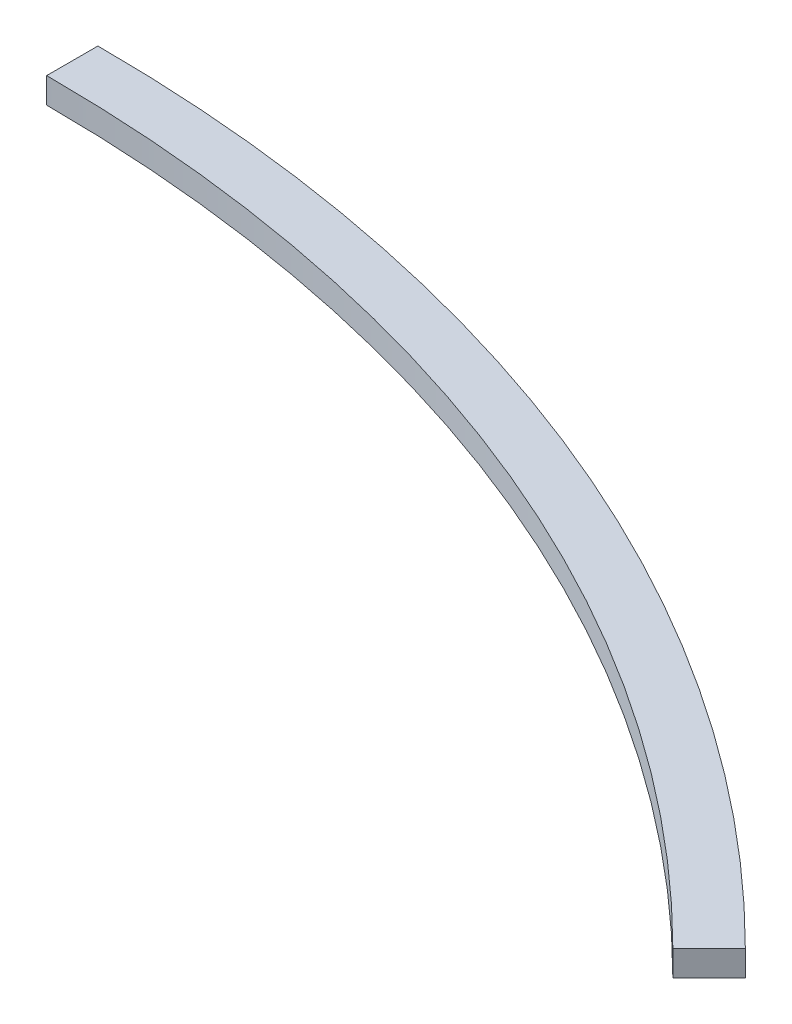
ISO-10303-21;
HEADER;
FILE_DESCRIPTION(('STEP AP214'),'2;1');
FILE_NAME('part.step','',(''),(''),'','','');
FILE_SCHEMA(('AUTOMOTIVE_DESIGN { 1 0 10303 214 1 1 1 1 }'));
ENDSEC;
DATA;
#1=APPLICATION_CONTEXT('core data for automotive mechanical design processes');
#2=APPLICATION_PROTOCOL_DEFINITION('international standard','automotive_design',2000,#1);
#3=PRODUCT_CONTEXT('',#1,'mechanical');
#4=PRODUCT('Part','Part','',(#3));
#5=PRODUCT_RELATED_PRODUCT_CATEGORY('part','',(#4));
#6=PRODUCT_DEFINITION_FORMATION('','',#4);
#7=PRODUCT_DEFINITION_CONTEXT('part definition',#1,'design');
#8=PRODUCT_DEFINITION('design','',#6,#7);
#9=PRODUCT_DEFINITION_SHAPE('','',#8);
#10=(LENGTH_UNIT() NAMED_UNIT(*) SI_UNIT(.MILLI.,.METRE.));
#11=(NAMED_UNIT(*) PLANE_ANGLE_UNIT() SI_UNIT($,.RADIAN.));
#12=(NAMED_UNIT(*) SI_UNIT($,.STERADIAN.) SOLID_ANGLE_UNIT());
#13=UNCERTAINTY_MEASURE_WITH_UNIT(LENGTH_MEASURE(1.E-05),#10,'distance_accuracy_value','');
#14=(GEOMETRIC_REPRESENTATION_CONTEXT(3) GLOBAL_UNCERTAINTY_ASSIGNED_CONTEXT((#13)) GLOBAL_UNIT_ASSIGNED_CONTEXT((#10,
#11,#12)) REPRESENTATION_CONTEXT('',''));
#15=CARTESIAN_POINT('',(0.,0.,0.));
#16=DIRECTION('',(0.,0.,1.));
#17=DIRECTION('',(1.,0.,0.));
#18=AXIS2_PLACEMENT_3D('',#15,#16,#17);
#19=CARTESIAN_POINT('',(0.,10.,0.));
#20=DIRECTION('',(0.,-1.,0.));
#21=DIRECTION('',(0.,0.,-1.));
#22=AXIS2_PLACEMENT_3D('',#19,#20,#21);
#23=CYLINDRICAL_SURFACE('',#22,610.);
#24=CARTESIAN_POINT('',(0.,0.,0.));
#25=DIRECTION('',(0.,1.,0.));
#26=DIRECTION('',(0.,0.,1.));
#27=AXIS2_PLACEMENT_3D('',#24,#25,#26);
#28=CIRCLE('',#27,610.);
#29=CARTESIAN_POINT('',(0.,0.,-610.));
#30=VERTEX_POINT('',#29);
#31=CARTESIAN_POINT('',(431.335136523795,0.,-431.335136523793));
#32=VERTEX_POINT('',#31);
#33=EDGE_CURVE('E95',#30,#32,#28,.F.);
#34=ORIENTED_EDGE('',*,*,#33,.F.);
#35=DIRECTION('',(0.,-1.,0.));
#36=VECTOR('',#35,1.);
#37=CARTESIAN_POINT('',(0.,10.,-610.));
#38=LINE('',#37,#36);
#39=CARTESIAN_POINT('',(0.,10.,-610.));
#40=VERTEX_POINT('',#39);
#41=EDGE_CURVE('E11',#40,#30,#38,.T.);
#42=ORIENTED_EDGE('',*,*,#41,.F.);
#43=CARTESIAN_POINT('',(0.,10.,0.));
#44=DIRECTION('',(0.,1.,0.));
#45=DIRECTION('',(0.,0.,1.));
#46=AXIS2_PLACEMENT_3D('',#43,#44,#45);
#47=CIRCLE('',#46,610.);
#48=CARTESIAN_POINT('',(431.335136523795,10.,-431.335136523793));
#49=VERTEX_POINT('',#48);
#50=EDGE_CURVE('E89',#40,#49,#47,.F.);
#51=ORIENTED_EDGE('',*,*,#50,.T.);
#52=DIRECTION('',(0.,-1.,0.));
#53=VECTOR('',#52,1.);
#54=CARTESIAN_POINT('',(431.335136523795,10.,-431.335136523793));
#55=LINE('',#54,#53);
#56=EDGE_CURVE('E70',#49,#32,#55,.T.);
#57=ORIENTED_EDGE('',*,*,#56,.T.);
#58=EDGE_LOOP('',(#34,#42,#51,#57));
#59=FACE_BOUND('',#58,.T.);
#60=ADVANCED_FACE('F32',(#59),#23,.T.);
#61=CARTESIAN_POINT('',(0.,10.,0.));
#62=DIRECTION('',(-1.,0.,0.));
#63=DIRECTION('',(0.,0.,1.));
#64=AXIS2_PLACEMENT_3D('',#61,#62,#63);
#65=PLANE('',#64);
#66=DIRECTION('',(0.,0.,-1.));
#67=VECTOR('',#66,1.);
#68=CARTESIAN_POINT('',(0.,0.,0.));
#69=LINE('',#68,#67);
#70=CARTESIAN_POINT('',(0.,0.,-590.));
#71=VERTEX_POINT('',#70);
#72=EDGE_CURVE('E83',#71,#30,#69,.T.);
#73=ORIENTED_EDGE('',*,*,#72,.F.);
#74=DIRECTION('',(0.,-1.,0.));
#75=VECTOR('',#74,1.);
#76=CARTESIAN_POINT('',(0.,10.,-590.));
#77=LINE('',#76,#75);
#78=CARTESIAN_POINT('',(0.,10.,-590.));
#79=VERTEX_POINT('',#78);
#80=EDGE_CURVE('E40',#79,#71,#77,.T.);
#81=ORIENTED_EDGE('',*,*,#80,.F.);
#82=DIRECTION('',(0.,0.,-1.));
#83=VECTOR('',#82,1.);
#84=CARTESIAN_POINT('',(0.,10.,0.));
#85=LINE('',#84,#83);
#86=EDGE_CURVE('E81',#79,#40,#85,.T.);
#87=ORIENTED_EDGE('',*,*,#86,.T.);
#88=ORIENTED_EDGE('',*,*,#41,.T.);
#89=EDGE_LOOP('',(#73,#81,#87,#88));
#90=FACE_BOUND('',#89,.T.);
#91=ADVANCED_FACE('F79',(#90),#65,.T.);
#92=CARTESIAN_POINT('',(0.,10.,0.));
#93=DIRECTION('',(0.,-1.,0.));
#94=DIRECTION('',(0.,0.,-1.));
#95=AXIS2_PLACEMENT_3D('',#92,#93,#94);
#96=CYLINDRICAL_SURFACE('',#95,590.);
#97=CARTESIAN_POINT('',(0.,0.,0.));
#98=DIRECTION('',(0.,1.,0.));
#99=DIRECTION('',(0.,0.,1.));
#100=AXIS2_PLACEMENT_3D('',#97,#98,#99);
#101=CIRCLE('',#100,590.);
#102=CARTESIAN_POINT('',(417.193000900064,0.,-417.193000900062));
#103=VERTEX_POINT('',#102);
#104=EDGE_CURVE('E63',#71,#103,#101,.F.);
#105=ORIENTED_EDGE('',*,*,#104,.T.);
#106=DIRECTION('',(0.,-1.,0.));
#107=VECTOR('',#106,1.);
#108=CARTESIAN_POINT('',(417.193000900064,10.,-417.193000900062));
#109=LINE('',#108,#107);
#110=CARTESIAN_POINT('',(417.193000900064,10.,-417.193000900062));
#111=VERTEX_POINT('',#110);
#112=EDGE_CURVE('E84',#111,#103,#109,.T.);
#113=ORIENTED_EDGE('',*,*,#112,.F.);
#114=CARTESIAN_POINT('',(0.,10.,0.));
#115=DIRECTION('',(0.,1.,0.));
#116=DIRECTION('',(0.,0.,1.));
#117=AXIS2_PLACEMENT_3D('',#114,#115,#116);
#118=CIRCLE('',#117,590.);
#119=EDGE_CURVE('E85',#79,#111,#118,.F.);
#120=ORIENTED_EDGE('',*,*,#119,.F.);
#121=ORIENTED_EDGE('',*,*,#80,.T.);
#122=EDGE_LOOP('',(#105,#113,#120,#121));
#123=FACE_BOUND('',#122,.T.);
#124=ADVANCED_FACE('F86',(#123),#96,.F.);
#125=CARTESIAN_POINT('',(-1.05981240961154E-12,10.,-1.05981240961155E-12));
#126=DIRECTION('',(-0.707106781186545,0.,-0.70710678118655));
#127=DIRECTION('',(-0.70710678118655,0.,0.707106781186545));
#128=AXIS2_PLACEMENT_3D('',#125,#126,#127);
#129=PLANE('',#128);
#130=DIRECTION('',(0.70710678118655,0.,-0.707106781186545));
#131=VECTOR('',#130,1.);
#132=CARTESIAN_POINT('',(-1.05981240961154E-12,0.,-1.05981240961155E-12));
#133=LINE('',#132,#131);
#134=EDGE_CURVE('E91',#103,#32,#133,.T.);
#135=ORIENTED_EDGE('',*,*,#134,.T.);
#136=ORIENTED_EDGE('',*,*,#56,.F.);
#137=DIRECTION('',(0.70710678118655,0.,-0.707106781186545));
#138=VECTOR('',#137,1.);
#139=CARTESIAN_POINT('',(-1.05981240961154E-12,10.,-1.05981240961155E-12));
#140=LINE('',#139,#138);
#141=EDGE_CURVE('E48',#111,#49,#140,.T.);
#142=ORIENTED_EDGE('',*,*,#141,.F.);
#143=ORIENTED_EDGE('',*,*,#112,.T.);
#144=EDGE_LOOP('',(#135,#136,#142,#143));
#145=FACE_BOUND('',#144,.T.);
#146=ADVANCED_FACE('F104',(#145),#129,.F.);
#147=CARTESIAN_POINT('',(0.,10.,0.));
#148=DIRECTION('',(0.,1.,0.));
#149=DIRECTION('',(0.,0.,1.));
#150=AXIS2_PLACEMENT_3D('',#147,#148,#149);
#151=PLANE('',#150);
#152=ORIENTED_EDGE('',*,*,#50,.F.);
#153=ORIENTED_EDGE('',*,*,#86,.F.);
#154=ORIENTED_EDGE('',*,*,#119,.T.);
#155=ORIENTED_EDGE('',*,*,#141,.T.);
#156=EDGE_LOOP('',(#152,#153,#154,#155));
#157=FACE_BOUND('',#156,.T.);
#158=ADVANCED_FACE('F88',(#157),#151,.T.);
#159=CARTESIAN_POINT('',(0.,0.,0.));
#160=DIRECTION('',(0.,1.,0.));
#161=DIRECTION('',(0.,0.,1.));
#162=AXIS2_PLACEMENT_3D('',#159,#160,#161);
#163=PLANE('',#162);
#164=ORIENTED_EDGE('',*,*,#33,.T.);
#165=ORIENTED_EDGE('',*,*,#134,.F.);
#166=ORIENTED_EDGE('',*,*,#104,.F.);
#167=ORIENTED_EDGE('',*,*,#72,.T.);
#168=EDGE_LOOP('',(#164,#165,#166,#167));
#169=FACE_BOUND('',#168,.T.);
#170=ADVANCED_FACE('F106',(#169),#163,.F.);
#171=CLOSED_SHELL('',(#60,#91,#124,#146,#158,#170));
#172=MANIFOLD_SOLID_BREP('B2',#171);
#173=ADVANCED_BREP_SHAPE_REPRESENTATION('',(#18,#172),#14);
#174=SHAPE_DEFINITION_REPRESENTATION(#9,#173);
ENDSEC;
END-ISO-10303-21;
